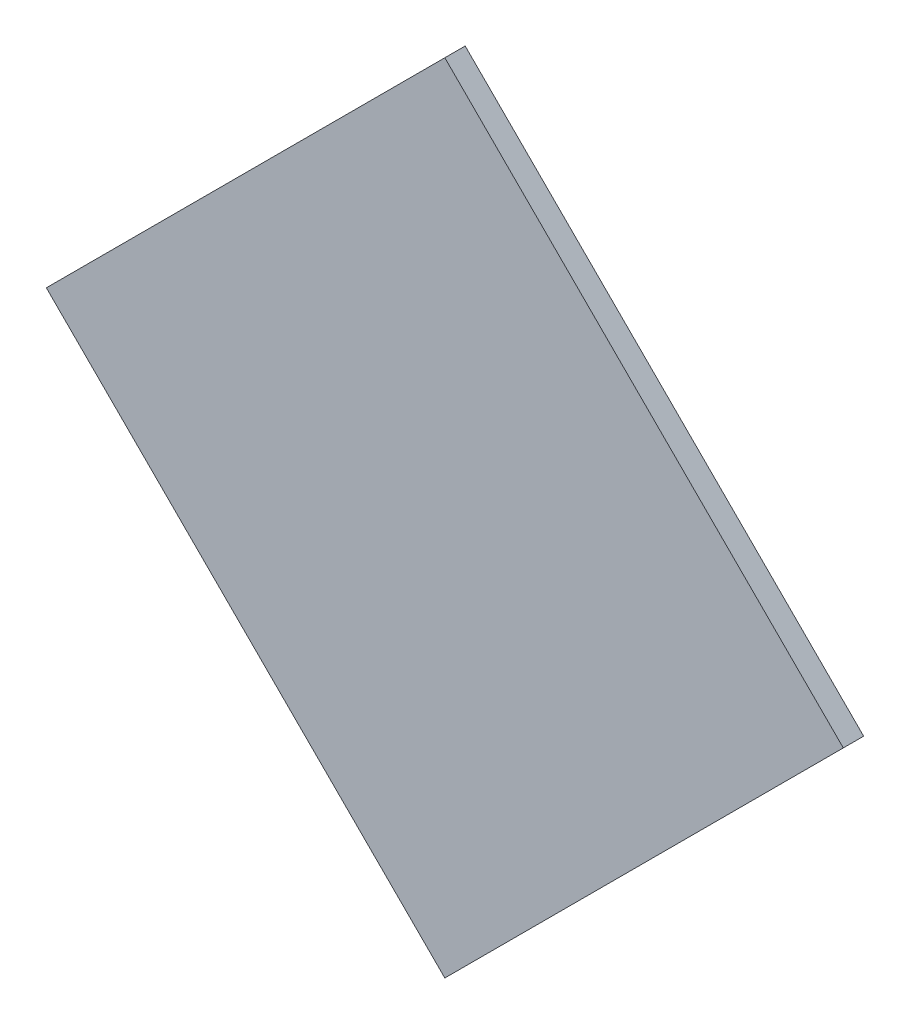
ISO-10303-21;
HEADER;
FILE_DESCRIPTION(('STEP AP214'),'2;1');
FILE_NAME('part.step','',(''),(''),'','','');
FILE_SCHEMA(('AUTOMOTIVE_DESIGN { 1 0 10303 214 1 1 1 1 }'));
ENDSEC;
DATA;
#1=APPLICATION_CONTEXT('core data for automotive mechanical design processes');
#2=APPLICATION_PROTOCOL_DEFINITION('international standard','automotive_design',2000,#1);
#3=PRODUCT_CONTEXT('',#1,'mechanical');
#4=PRODUCT('Part','Part','',(#3));
#5=PRODUCT_RELATED_PRODUCT_CATEGORY('part','',(#4));
#6=PRODUCT_DEFINITION_FORMATION('','',#4);
#7=PRODUCT_DEFINITION_CONTEXT('part definition',#1,'design');
#8=PRODUCT_DEFINITION('design','',#6,#7);
#9=PRODUCT_DEFINITION_SHAPE('','',#8);
#10=(LENGTH_UNIT() NAMED_UNIT(*) SI_UNIT(.MILLI.,.METRE.));
#11=(NAMED_UNIT(*) PLANE_ANGLE_UNIT() SI_UNIT($,.RADIAN.));
#12=(NAMED_UNIT(*) SI_UNIT($,.STERADIAN.) SOLID_ANGLE_UNIT());
#13=UNCERTAINTY_MEASURE_WITH_UNIT(LENGTH_MEASURE(1.E-05),#10,'distance_accuracy_value','');
#14=(GEOMETRIC_REPRESENTATION_CONTEXT(3) GLOBAL_UNCERTAINTY_ASSIGNED_CONTEXT((#13)) GLOBAL_UNIT_ASSIGNED_CONTEXT((#10,
#11,#12)) REPRESENTATION_CONTEXT('',''));
#15=CARTESIAN_POINT('',(0.,0.,0.));
#16=DIRECTION('',(0.,0.,1.));
#17=DIRECTION('',(1.,0.,0.));
#18=AXIS2_PLACEMENT_3D('',#15,#16,#17);
#19=CARTESIAN_POINT('',(5.28167,3.117126416875,0.76487));
#20=DIRECTION('',(0.,0.,-1.));
#21=DIRECTION('',(-1.,0.,0.));
#22=AXIS2_PLACEMENT_3D('',#19,#20,#21);
#23=PLANE('',#22);
#24=DIRECTION('',(0.707106781186548,0.707106781186548,0.));
#25=VECTOR('',#24,1.);
#26=CARTESIAN_POINT('',(4.609918667,3.117126667,0.76487));
#27=LINE('',#26,#25);
#28=CARTESIAN_POINT('',(4.609918667,3.117126667,0.76487));
#29=VERTEX_POINT('',#28);
#30=CARTESIAN_POINT('',(5.28167,3.788878,0.76487));
#31=VERTEX_POINT('',#30);
#32=EDGE_CURVE('E55',#29,#31,#27,.T.);
#33=ORIENTED_EDGE('',*,*,#32,.T.);
#34=DIRECTION('',(0.707106781186548,-0.707106781186548,0.));
#35=VECTOR('',#34,1.);
#36=CARTESIAN_POINT('',(5.28167,3.788878,0.76487));
#37=LINE('',#36,#35);
#38=CARTESIAN_POINT('',(5.953421333,3.117126667,0.76487));
#39=VERTEX_POINT('',#38);
#40=EDGE_CURVE('E57',#31,#39,#37,.T.);
#41=ORIENTED_EDGE('',*,*,#40,.T.);
#42=DIRECTION('',(-0.70710643013396,-0.70710713223896,0.));
#43=VECTOR('',#42,1.);
#44=CARTESIAN_POINT('',(5.953421333,3.117126667,0.76487));
#45=LINE('',#44,#43);
#46=CARTESIAN_POINT('',(5.28166999999999,2.44537466700001,0.76487));
#47=VERTEX_POINT('',#46);
#48=EDGE_CURVE('E20',#39,#47,#45,.T.);
#49=ORIENTED_EDGE('',*,*,#48,.T.);
#50=DIRECTION('',(-0.70710643013396,0.70710713223896,0.));
#51=VECTOR('',#50,1.);
#52=CARTESIAN_POINT('',(5.28167,2.445374667,0.76487));
#53=LINE('',#52,#51);
#54=EDGE_CURVE('E80',#47,#29,#53,.T.);
#55=ORIENTED_EDGE('',*,*,#54,.T.);
#56=EDGE_LOOP('',(#33,#41,#49,#55));
#57=FACE_BOUND('',#56,.T.);
#58=ADVANCED_FACE('F17',(#57),#23,.T.);
#59=CARTESIAN_POINT('',(5.953421333,3.117126667,0.76487));
#60=DIRECTION('',(-0.70710713223896,0.70710643013396,0.));
#61=DIRECTION('',(-0.70710643013396,-0.70710713223896,0.));
#62=AXIS2_PLACEMENT_3D('',#59,#60,#61);
#63=PLANE('',#62);
#64=DIRECTION('',(0.,0.,1.));
#65=VECTOR('',#64,1.);
#66=CARTESIAN_POINT('',(5.28167,2.445374667,0.76487));
#67=LINE('',#66,#65);
#68=CARTESIAN_POINT('',(5.28166999999999,2.44537466700001,0.79916));
#69=VERTEX_POINT('',#68);
#70=EDGE_CURVE('E68',#69,#47,#67,.F.);
#71=ORIENTED_EDGE('',*,*,#70,.T.);
#72=ORIENTED_EDGE('',*,*,#48,.F.);
#73=DIRECTION('',(0.,0.,1.));
#74=VECTOR('',#73,1.);
#75=CARTESIAN_POINT('',(5.953421333,3.117126667,0.76487));
#76=LINE('',#75,#74);
#77=CARTESIAN_POINT('',(5.953421333,3.117126667,0.79916));
#78=VERTEX_POINT('',#77);
#79=EDGE_CURVE('E63',#39,#78,#76,.T.);
#80=ORIENTED_EDGE('',*,*,#79,.T.);
#81=DIRECTION('',(0.707106430133946,0.707107132238975,0.));
#82=VECTOR('',#81,1.);
#83=CARTESIAN_POINT('',(5.28167,2.445374667,0.79916));
#84=LINE('',#83,#82);
#85=EDGE_CURVE('E83',#69,#78,#84,.T.);
#86=ORIENTED_EDGE('',*,*,#85,.F.);
#87=EDGE_LOOP('',(#71,#72,#80,#86));
#88=FACE_BOUND('',#87,.T.);
#89=ADVANCED_FACE('F65',(#88),#63,.F.);
#90=CARTESIAN_POINT('',(5.28167,3.788878,0.76487));
#91=DIRECTION('',(-0.707106781186548,-0.707106781186548,0.));
#92=DIRECTION('',(0.707106781186548,-0.707106781186548,0.));
#93=AXIS2_PLACEMENT_3D('',#90,#91,#92);
#94=PLANE('',#93);
#95=ORIENTED_EDGE('',*,*,#79,.F.);
#96=ORIENTED_EDGE('',*,*,#40,.F.);
#97=DIRECTION('',(0.,0.,1.));
#98=VECTOR('',#97,1.);
#99=CARTESIAN_POINT('',(5.28167,3.788878,0.76487));
#100=LINE('',#99,#98);
#101=CARTESIAN_POINT('',(5.28167,3.788878,0.79916));
#102=VERTEX_POINT('',#101);
#103=EDGE_CURVE('E75',#31,#102,#100,.T.);
#104=ORIENTED_EDGE('',*,*,#103,.T.);
#105=DIRECTION('',(-0.707106781186547,0.707106781186548,0.));
#106=VECTOR('',#105,1.);
#107=CARTESIAN_POINT('',(5.953421333,3.117126667,0.79916));
#108=LINE('',#107,#106);
#109=EDGE_CURVE('E72',#78,#102,#108,.T.);
#110=ORIENTED_EDGE('',*,*,#109,.F.);
#111=EDGE_LOOP('',(#95,#96,#104,#110));
#112=FACE_BOUND('',#111,.T.);
#113=ADVANCED_FACE('F70',(#112),#94,.F.);
#114=CARTESIAN_POINT('',(4.609918667,3.117126667,0.76487));
#115=DIRECTION('',(0.707106781186548,-0.707106781186548,0.));
#116=DIRECTION('',(0.707106781186548,0.707106781186548,0.));
#117=AXIS2_PLACEMENT_3D('',#114,#115,#116);
#118=PLANE('',#117);
#119=ORIENTED_EDGE('',*,*,#103,.F.);
#120=ORIENTED_EDGE('',*,*,#32,.F.);
#121=DIRECTION('',(0.,0.,1.));
#122=VECTOR('',#121,1.);
#123=CARTESIAN_POINT('',(4.60991866699999,3.11712666699999,0.76487));
#124=LINE('',#123,#122);
#125=CARTESIAN_POINT('',(4.609918667,3.117126667,0.79916));
#126=VERTEX_POINT('',#125);
#127=EDGE_CURVE('E35',#29,#126,#124,.T.);
#128=ORIENTED_EDGE('',*,*,#127,.T.);
#129=DIRECTION('',(-0.707106781186548,-0.707106781186547,0.));
#130=VECTOR('',#129,1.);
#131=CARTESIAN_POINT('',(5.28167,3.788878,0.79916));
#132=LINE('',#131,#130);
#133=EDGE_CURVE('E26',#102,#126,#132,.T.);
#134=ORIENTED_EDGE('',*,*,#133,.F.);
#135=EDGE_LOOP('',(#119,#120,#128,#134));
#136=FACE_BOUND('',#135,.T.);
#137=ADVANCED_FACE('F89',(#136),#118,.F.);
#138=CARTESIAN_POINT('',(5.28167,2.445374667,0.76487));
#139=DIRECTION('',(0.70710713223896,0.70710643013396,0.));
#140=DIRECTION('',(-0.70710643013396,0.70710713223896,0.));
#141=AXIS2_PLACEMENT_3D('',#138,#139,#140);
#142=PLANE('',#141);
#143=ORIENTED_EDGE('',*,*,#127,.F.);
#144=ORIENTED_EDGE('',*,*,#54,.F.);
#145=ORIENTED_EDGE('',*,*,#70,.F.);
#146=DIRECTION('',(0.707106430133947,-0.707107132238974,0.));
#147=VECTOR('',#146,1.);
#148=CARTESIAN_POINT('',(4.609918667,3.117126667,0.79916));
#149=LINE('',#148,#147);
#150=EDGE_CURVE('E11',#126,#69,#149,.T.);
#151=ORIENTED_EDGE('',*,*,#150,.F.);
#152=EDGE_LOOP('',(#143,#144,#145,#151));
#153=FACE_BOUND('',#152,.T.);
#154=ADVANCED_FACE('F91',(#153),#142,.F.);
#155=CARTESIAN_POINT('',(5.28167,3.117126416875,0.79916));
#156=DIRECTION('',(0.,0.,1.));
#157=DIRECTION('',(0.,-1.,0.));
#158=AXIS2_PLACEMENT_3D('',#155,#156,#157);
#159=PLANE('',#158);
#160=ORIENTED_EDGE('',*,*,#133,.T.);
#161=ORIENTED_EDGE('',*,*,#150,.T.);
#162=ORIENTED_EDGE('',*,*,#85,.T.);
#163=ORIENTED_EDGE('',*,*,#109,.T.);
#164=EDGE_LOOP('',(#160,#161,#162,#163));
#165=FACE_BOUND('',#164,.T.);
#166=ADVANCED_FACE('F88',(#165),#159,.T.);
#167=CLOSED_SHELL('',(#58,#89,#113,#137,#154,#166));
#168=MANIFOLD_SOLID_BREP('B1',#167);
#169=ADVANCED_BREP_SHAPE_REPRESENTATION('',(#18,#168),#14);
#170=SHAPE_DEFINITION_REPRESENTATION(#9,#169);
ENDSEC;
END-ISO-10303-21;
